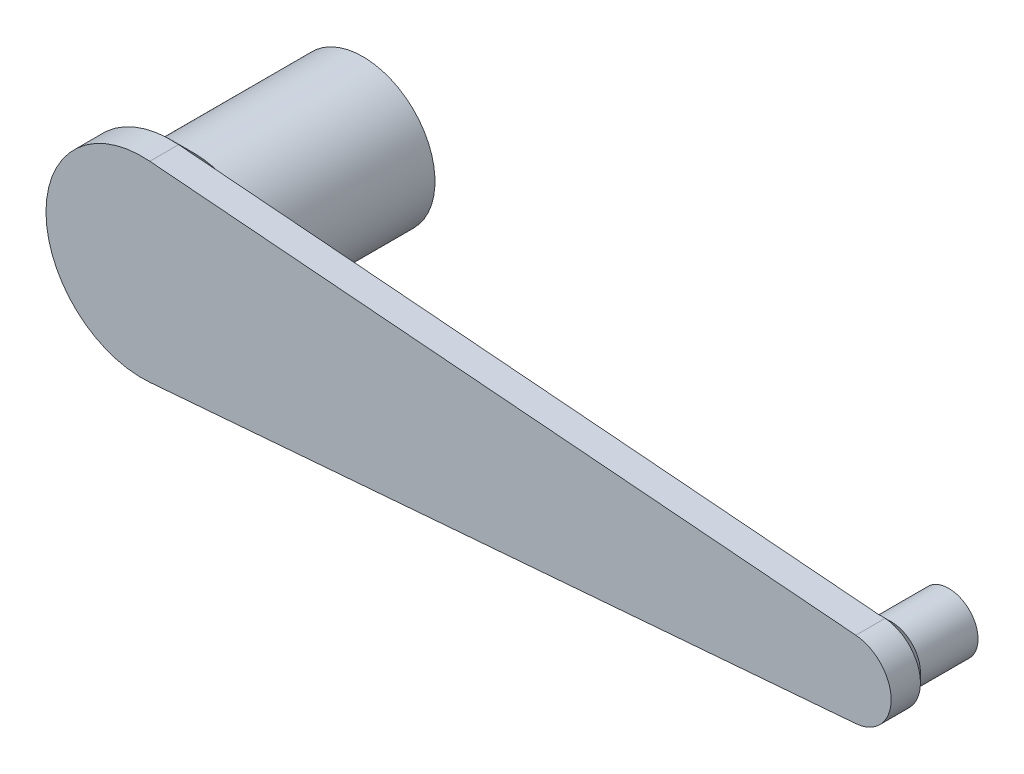
ISO-10303-21;
HEADER;
FILE_DESCRIPTION(('STEP AP214'),'2;1');
FILE_NAME('part.step','',(''),(''),'','','');
FILE_SCHEMA(('AUTOMOTIVE_DESIGN { 1 0 10303 214 1 1 1 1 }'));
ENDSEC;
DATA;
#1=APPLICATION_CONTEXT('core data for automotive mechanical design processes');
#2=APPLICATION_PROTOCOL_DEFINITION('international standard','automotive_design',2000,#1);
#3=PRODUCT_CONTEXT('',#1,'mechanical');
#4=PRODUCT('Part','Part','',(#3));
#5=PRODUCT_RELATED_PRODUCT_CATEGORY('part','',(#4));
#6=PRODUCT_DEFINITION_FORMATION('','',#4);
#7=PRODUCT_DEFINITION_CONTEXT('part definition',#1,'design');
#8=PRODUCT_DEFINITION('design','',#6,#7);
#9=PRODUCT_DEFINITION_SHAPE('','',#8);
#10=(LENGTH_UNIT() NAMED_UNIT(*) SI_UNIT(.MILLI.,.METRE.));
#11=(NAMED_UNIT(*) PLANE_ANGLE_UNIT() SI_UNIT($,.RADIAN.));
#12=(NAMED_UNIT(*) SI_UNIT($,.STERADIAN.) SOLID_ANGLE_UNIT());
#13=UNCERTAINTY_MEASURE_WITH_UNIT(LENGTH_MEASURE(1.E-05),#10,'distance_accuracy_value','');
#14=(GEOMETRIC_REPRESENTATION_CONTEXT(3) GLOBAL_UNCERTAINTY_ASSIGNED_CONTEXT((#13)) GLOBAL_UNIT_ASSIGNED_CONTEXT((#10,
#11,#12)) REPRESENTATION_CONTEXT('',''));
#15=CARTESIAN_POINT('',(0.,0.,0.));
#16=DIRECTION('',(0.,0.,1.));
#17=DIRECTION('',(1.,0.,0.));
#18=AXIS2_PLACEMENT_3D('',#15,#16,#17);
#19=CARTESIAN_POINT('',(0.,0.,3.));
#20=DIRECTION('',(0.,0.,-1.));
#21=DIRECTION('',(-1.,0.,0.));
#22=AXIS2_PLACEMENT_3D('',#19,#20,#21);
#23=CYLINDRICAL_SURFACE('',#22,10.);
#24=CARTESIAN_POINT('',(0.,0.,0.));
#25=DIRECTION('',(0.,0.,1.));
#26=DIRECTION('',(-1.,0.,0.));
#27=AXIS2_PLACEMENT_3D('',#24,#25,#26);
#28=CIRCLE('',#27,10.);
#29=CARTESIAN_POINT('',(0.810810810810811,9.96707508896528,0.));
#30=VERTEX_POINT('',#29);
#31=CARTESIAN_POINT('',(0.81081081081082,-9.96707508896528,0.));
#32=VERTEX_POINT('',#31);
#33=EDGE_CURVE('E116',#30,#32,#28,.T.);
#34=ORIENTED_EDGE('',*,*,#33,.T.);
#35=DIRECTION('',(0.,0.,-1.));
#36=VECTOR('',#35,1.);
#37=CARTESIAN_POINT('',(0.81081081081082,-9.96707508896528,3.));
#38=LINE('',#37,#36);
#39=CARTESIAN_POINT('',(0.81081081081082,-9.96707508896528,3.));
#40=VERTEX_POINT('',#39);
#41=EDGE_CURVE('E100',#40,#32,#38,.T.);
#42=ORIENTED_EDGE('',*,*,#41,.F.);
#43=CARTESIAN_POINT('',(0.,0.,3.));
#44=DIRECTION('',(0.,0.,1.));
#45=DIRECTION('',(-1.,0.,0.));
#46=AXIS2_PLACEMENT_3D('',#43,#44,#45);
#47=CIRCLE('',#46,10.);
#48=CARTESIAN_POINT('',(0.810810810810811,9.96707508896528,3.));
#49=VERTEX_POINT('',#48);
#50=EDGE_CURVE('E105',#49,#40,#47,.T.);
#51=ORIENTED_EDGE('',*,*,#50,.F.);
#52=DIRECTION('',(0.,0.,-1.));
#53=VECTOR('',#52,1.);
#54=CARTESIAN_POINT('',(0.810810810810811,9.96707508896528,3.));
#55=LINE('',#54,#53);
#56=EDGE_CURVE('E304',#49,#30,#55,.T.);
#57=ORIENTED_EDGE('',*,*,#56,.T.);
#58=EDGE_LOOP('',(#34,#42,#51,#57));
#59=FACE_BOUND('',#58,.T.);
#60=ADVANCED_FACE('F45',(#59),#23,.T.);
#61=CARTESIAN_POINT('',(74.3243243243243,-3.98683003558611,3.));
#62=DIRECTION('',(-0.0810810810810811,0.996707508896528,0.));
#63=DIRECTION('',(-0.996707508896528,-0.0810810810810811,0.));
#64=AXIS2_PLACEMENT_3D('',#61,#62,#63);
#65=PLANE('',#64);
#66=DIRECTION('',(0.996707508896528,0.0810810810810811,0.));
#67=VECTOR('',#66,1.);
#68=CARTESIAN_POINT('',(74.3243243243243,-3.98683003558611,0.));
#69=LINE('',#68,#67);
#70=CARTESIAN_POINT('',(73.6919842987352,-4.03827021480415,0.));
#71=VERTEX_POINT('',#70);
#72=EDGE_CURVE('E296',#32,#71,#69,.T.);
#73=ORIENTED_EDGE('',*,*,#72,.T.);
#74=CARTESIAN_POINT('',(73.6919842987352,-4.03827021480415,0.));
#75=CARTESIAN_POINT('',(73.7442956502319,-4.03401474276817,-0.00822470448053856));
#76=CARTESIAN_POINT('',(73.7967617841526,-4.0297466793489,-0.0154723488356455));
#77=CARTESIAN_POINT('',(73.9018514925602,-4.02119774489007,-0.0279440046137584));
#78=CARTESIAN_POINT('',(73.95447470798,-4.01691690306022,-0.0331710659839847));
#79=CARTESIAN_POINT('',(74.0598871762658,-4.00834171243333,-0.0415574676224749));
#80=CARTESIAN_POINT('',(74.1126764345497,-4.00404736319554,-0.0447167397021608));
#81=CARTESIAN_POINT('',(74.2184182000827,-3.99544538459269,-0.0489415333459449));
#82=CARTESIAN_POINT('',(74.271370833499,-3.99113774496404,-0.0500038701051256));
#83=CARTESIAN_POINT('',(74.3243243243243,-3.98683003558611,-0.0500000000000007));
#84=B_SPLINE_CURVE_WITH_KNOTS('',3,(#74,#75,#76,#77,#78,#79,#80,#81,#82,#83),.UNSPECIFIED.,.F.,
.F.,(4,2,2,2,4),(0.,0.159368060338297,0.31849461609862,0.47762641904103,0.636999724416219),.UNSPECIFIED.);
#85=CARTESIAN_POINT('',(74.3243243243243,-3.98683003558611,-0.050000000000001));
#86=VERTEX_POINT('',#85);
#87=EDGE_CURVE('E132',#71,#86,#84,.T.);
#88=ORIENTED_EDGE('',*,*,#87,.T.);
#89=DIRECTION('',(0.,0.,-1.));
#90=VECTOR('',#89,1.);
#91=CARTESIAN_POINT('',(74.3243243243243,-3.98683003558611,3.));
#92=LINE('',#91,#90);
#93=CARTESIAN_POINT('',(74.3243243243243,-3.98683003558611,3.));
#94=VERTEX_POINT('',#93);
#95=EDGE_CURVE('E69',#94,#86,#92,.T.);
#96=ORIENTED_EDGE('',*,*,#95,.F.);
#97=DIRECTION('',(0.996707508896528,0.0810810810810811,0.));
#98=VECTOR('',#97,1.);
#99=CARTESIAN_POINT('',(74.3243243243243,-3.98683003558611,3.));
#100=LINE('',#99,#98);
#101=EDGE_CURVE('E95',#40,#94,#100,.T.);
#102=ORIENTED_EDGE('',*,*,#101,.F.);
#103=ORIENTED_EDGE('',*,*,#41,.T.);
#104=EDGE_LOOP('',(#73,#88,#96,#102,#103));
#105=FACE_BOUND('',#104,.T.);
#106=ADVANCED_FACE('F98',(#105),#65,.F.);
#107=CARTESIAN_POINT('',(74.,0.,3.));
#108=DIRECTION('',(0.,0.,-1.));
#109=DIRECTION('',(-1.,0.,0.));
#110=AXIS2_PLACEMENT_3D('',#107,#108,#109);
#111=CYLINDRICAL_SURFACE('',#110,4.);
#112=ORIENTED_EDGE('',*,*,#95,.T.);
#113=CARTESIAN_POINT('',(74.,0.,-0.0500000000000002));
#114=DIRECTION('',(0.,0.,1.));
#115=DIRECTION('',(1.,0.,0.));
#116=AXIS2_PLACEMENT_3D('',#113,#114,#115);
#117=CIRCLE('',#116,4.);
#118=CARTESIAN_POINT('',(74.3243243243243,3.98683003558611,-0.0500000000000006));
#119=VERTEX_POINT('',#118);
#120=EDGE_CURVE('E140',#86,#119,#117,.T.);
#121=ORIENTED_EDGE('',*,*,#120,.T.);
#122=DIRECTION('',(0.,0.,-1.));
#123=VECTOR('',#122,1.);
#124=CARTESIAN_POINT('',(74.3243243243243,3.98683003558611,3.));
#125=LINE('',#124,#123);
#126=CARTESIAN_POINT('',(74.3243243243243,3.98683003558611,3.));
#127=VERTEX_POINT('',#126);
#128=EDGE_CURVE('E62',#127,#119,#125,.T.);
#129=ORIENTED_EDGE('',*,*,#128,.F.);
#130=CARTESIAN_POINT('',(74.,0.,3.));
#131=DIRECTION('',(0.,0.,1.));
#132=DIRECTION('',(-1.,0.,0.));
#133=AXIS2_PLACEMENT_3D('',#130,#131,#132);
#134=CIRCLE('',#133,4.);
#135=EDGE_CURVE('E104',#94,#127,#134,.T.);
#136=ORIENTED_EDGE('',*,*,#135,.F.);
#137=EDGE_LOOP('',(#112,#121,#129,#136));
#138=FACE_BOUND('',#137,.T.);
#139=ADVANCED_FACE('F166',(#138),#111,.T.);
#140=CARTESIAN_POINT('',(0.810810810810811,9.96707508896528,3.));
#141=DIRECTION('',(-0.0810810810810811,-0.996707508896528,0.));
#142=DIRECTION('',(0.996707508896528,-0.0810810810810811,0.));
#143=AXIS2_PLACEMENT_3D('',#140,#141,#142);
#144=PLANE('',#143);
#145=ORIENTED_EDGE('',*,*,#128,.T.);
#146=CARTESIAN_POINT('',(74.3243243243243,3.98683003558611,-0.0500000000000004));
#147=CARTESIAN_POINT('',(74.2713708334991,3.99113774496404,-0.0500038701051236));
#148=CARTESIAN_POINT('',(74.2184182000827,3.99544538459269,-0.0489415333459422));
#149=CARTESIAN_POINT('',(74.1126764345497,4.00404736319555,-0.044716739702158));
#150=CARTESIAN_POINT('',(74.0598871762658,4.00834171243333,-0.0415574676224724));
#151=CARTESIAN_POINT('',(73.95447470798,4.01691690306022,-0.0331710659839832));
#152=CARTESIAN_POINT('',(73.9018514925602,4.02119774489007,-0.0279440046137577));
#153=CARTESIAN_POINT('',(73.7967617841526,4.0297466793489,-0.015472348835646));
#154=CARTESIAN_POINT('',(73.7442956502319,4.03401474276817,-0.00822470448053942));
#155=CARTESIAN_POINT('',(73.6919842987352,4.03827021480415,0.));
#156=B_SPLINE_CURVE_WITH_KNOTS('',3,(#146,#147,#148,#149,#150,#151,#152,#153,#154,#155),
.UNSPECIFIED.,.F.,.F.,(4,2,2,2,4),(0.,0.159373305375176,0.318505108317586,0.477631664077895,
0.636999724416192),.UNSPECIFIED.);
#157=CARTESIAN_POINT('',(73.6919842987352,4.03827021480415,0.));
#158=VERTEX_POINT('',#157);
#159=EDGE_CURVE('E155',#119,#158,#156,.T.);
#160=ORIENTED_EDGE('',*,*,#159,.T.);
#161=DIRECTION('',(-0.996707508896528,0.0810810810810811,0.));
#162=VECTOR('',#161,1.);
#163=CARTESIAN_POINT('',(0.810810810810811,9.96707508896528,0.));
#164=LINE('',#163,#162);
#165=EDGE_CURVE('E114',#158,#30,#164,.T.);
#166=ORIENTED_EDGE('',*,*,#165,.T.);
#167=ORIENTED_EDGE('',*,*,#56,.F.);
#168=DIRECTION('',(-0.996707508896528,0.0810810810810811,0.));
#169=VECTOR('',#168,1.);
#170=CARTESIAN_POINT('',(0.810810810810811,9.96707508896528,3.));
#171=LINE('',#170,#169);
#172=EDGE_CURVE('E109',#127,#49,#171,.T.);
#173=ORIENTED_EDGE('',*,*,#172,.F.);
#174=EDGE_LOOP('',(#145,#160,#166,#167,#173));
#175=FACE_BOUND('',#174,.T.);
#176=ADVANCED_FACE('F162',(#175),#144,.F.);
#177=CARTESIAN_POINT('',(0.,0.,3.));
#178=DIRECTION('',(0.,0.,-1.));
#179=DIRECTION('',(-1.,0.,0.));
#180=AXIS2_PLACEMENT_3D('',#177,#178,#179);
#181=PLANE('',#180);
#182=ORIENTED_EDGE('',*,*,#50,.T.);
#183=ORIENTED_EDGE('',*,*,#101,.T.);
#184=ORIENTED_EDGE('',*,*,#135,.T.);
#185=ORIENTED_EDGE('',*,*,#172,.T.);
#186=EDGE_LOOP('',(#182,#183,#184,#185));
#187=FACE_BOUND('',#186,.T.);
#188=ADVANCED_FACE('F108',(#187),#181,.F.);
#189=CARTESIAN_POINT('',(0.,0.,0.));
#190=DIRECTION('',(0.,0.,-1.));
#191=DIRECTION('',(-1.,0.,0.));
#192=AXIS2_PLACEMENT_3D('',#189,#190,#191);
#193=PLANE('',#192);
#194=ORIENTED_EDGE('',*,*,#72,.F.);
#195=CARTESIAN_POINT('',(0.,0.,0.));
#196=DIRECTION('',(0.,0.,-1.));
#197=DIRECTION('',(-1.,0.,0.));
#198=AXIS2_PLACEMENT_3D('',#195,#196,#197);
#199=CIRCLE('',#198,9.99999999999997);
#200=EDGE_CURVE('E11',#32,#30,#199,.F.);
#201=ORIENTED_EDGE('',*,*,#200,.T.);
#202=ORIENTED_EDGE('',*,*,#165,.F.);
#203=CARTESIAN_POINT('',(74.,0.,0.));
#204=DIRECTION('',(0.,0.,-1.));
#205=DIRECTION('',(-1.,0.,0.));
#206=AXIS2_PLACEMENT_3D('',#203,#204,#205);
#207=CIRCLE('',#206,4.05);
#208=EDGE_CURVE('E124',#158,#71,#207,.F.);
#209=ORIENTED_EDGE('',*,*,#208,.T.);
#210=EDGE_LOOP('',(#194,#201,#202,#209));
#211=FACE_BOUND('',#210,.T.);
#212=ADVANCED_FACE('F167',(#211),#193,.T.);
#213=CARTESIAN_POINT('',(74.,0.,-7.));
#214=DIRECTION('',(0.,0.,1.));
#215=DIRECTION('',(1.,0.,0.));
#216=AXIS2_PLACEMENT_3D('',#213,#214,#215);
#217=CYLINDRICAL_SURFACE('',#216,3.04999999999999);
#218=CARTESIAN_POINT('',(74.,0.,-1.00000000000002));
#219=DIRECTION('',(0.,0.,-1.));
#220=DIRECTION('',(-1.,0.,0.));
#221=AXIS2_PLACEMENT_3D('',#218,#219,#220);
#222=CIRCLE('',#221,3.04999999999999);
#223=CARTESIAN_POINT('',(70.95,0.,-1.00000000000002));
#224=VERTEX_POINT('',#223);
#225=EDGE_CURVE('E119',#224,#224,#222,.T.);
#226=ORIENTED_EDGE('',*,*,#225,.T.);
#227=EDGE_LOOP('',(#226));
#228=FACE_BOUND('',#227,.T.);
#229=CARTESIAN_POINT('',(74.,0.,-7.));
#230=DIRECTION('',(0.,0.,-1.));
#231=DIRECTION('',(-1.,0.,0.));
#232=AXIS2_PLACEMENT_3D('',#229,#230,#231);
#233=CIRCLE('',#232,3.04999999999999);
#234=CARTESIAN_POINT('',(70.95,0.,-7.));
#235=VERTEX_POINT('',#234);
#236=EDGE_CURVE('E289',#235,#235,#233,.T.);
#237=ORIENTED_EDGE('',*,*,#236,.F.);
#238=EDGE_LOOP('',(#237));
#239=FACE_BOUND('',#238,.T.);
#240=ADVANCED_FACE('F201',(#228,#239),#217,.T.);
#241=CARTESIAN_POINT('',(74.,0.,-7.));
#242=DIRECTION('',(0.,0.,-1.));
#243=DIRECTION('',(-1.,0.,0.));
#244=AXIS2_PLACEMENT_3D('',#241,#242,#243);
#245=PLANE('',#244);
#246=ORIENTED_EDGE('',*,*,#236,.T.);
#247=EDGE_LOOP('',(#246));
#248=FACE_BOUND('',#247,.T.);
#249=ADVANCED_FACE('F152',(#248),#245,.T.);
#250=CARTESIAN_POINT('',(74.,0.,-1.00000000000002));
#251=DIRECTION('',(0.,0.,1.));
#252=DIRECTION('',(1.,0.,0.));
#253=AXIS2_PLACEMENT_3D('',#250,#251,#252);
#254=CONICAL_SURFACE('',#253,3.04999999999999,0.785398163397443);
#255=ORIENTED_EDGE('',*,*,#87,.F.);
#256=ORIENTED_EDGE('',*,*,#208,.F.);
#257=ORIENTED_EDGE('',*,*,#159,.F.);
#258=ORIENTED_EDGE('',*,*,#120,.F.);
#259=EDGE_LOOP('',(#255,#256,#257,#258));
#260=FACE_BOUND('',#259,.T.);
#261=ORIENTED_EDGE('',*,*,#225,.F.);
#262=EDGE_LOOP('',(#261));
#263=FACE_BOUND('',#262,.T.);
#264=ADVANCED_FACE('F146',(#260,#263),#254,.T.);
#265=CARTESIAN_POINT('',(0.,0.,-20.));
#266=DIRECTION('',(0.,0.,1.));
#267=DIRECTION('',(1.,0.,0.));
#268=AXIS2_PLACEMENT_3D('',#265,#266,#267);
#269=CYLINDRICAL_SURFACE('',#268,7.5);
#270=CARTESIAN_POINT('',(0.,0.,-2.5));
#271=DIRECTION('',(0.,0.,-1.));
#272=DIRECTION('',(-1.,0.,0.));
#273=AXIS2_PLACEMENT_3D('',#270,#271,#272);
#274=CIRCLE('',#273,7.5);
#275=CARTESIAN_POINT('',(-7.5,0.,-2.5));
#276=VERTEX_POINT('',#275);
#277=EDGE_CURVE('E55',#276,#276,#274,.T.);
#278=ORIENTED_EDGE('',*,*,#277,.T.);
#279=EDGE_LOOP('',(#278));
#280=FACE_BOUND('',#279,.T.);
#281=CARTESIAN_POINT('',(0.,0.,-20.));
#282=DIRECTION('',(0.,0.,-1.));
#283=DIRECTION('',(-1.,0.,0.));
#284=AXIS2_PLACEMENT_3D('',#281,#282,#283);
#285=CIRCLE('',#284,7.5);
#286=CARTESIAN_POINT('',(-7.5,0.,-20.));
#287=VERTEX_POINT('',#286);
#288=EDGE_CURVE('E292',#287,#287,#285,.T.);
#289=ORIENTED_EDGE('',*,*,#288,.F.);
#290=EDGE_LOOP('',(#289));
#291=FACE_BOUND('',#290,.T.);
#292=ADVANCED_FACE('F151',(#280,#291),#269,.T.);
#293=CARTESIAN_POINT('',(0.,0.,-20.));
#294=DIRECTION('',(0.,0.,-1.));
#295=DIRECTION('',(-1.,0.,0.));
#296=AXIS2_PLACEMENT_3D('',#293,#294,#295);
#297=PLANE('',#296);
#298=ORIENTED_EDGE('',*,*,#288,.T.);
#299=EDGE_LOOP('',(#298));
#300=FACE_BOUND('',#299,.T.);
#301=ADVANCED_FACE('F213',(#300),#297,.T.);
#302=CARTESIAN_POINT('',(0.,0.,-2.5));
#303=DIRECTION('',(0.,0.,1.));
#304=DIRECTION('',(1.,0.,0.));
#305=AXIS2_PLACEMENT_3D('',#302,#303,#304);
#306=CONICAL_SURFACE('',#305,7.5,0.785398163397442);
#307=ORIENTED_EDGE('',*,*,#33,.F.);
#308=ORIENTED_EDGE('',*,*,#200,.F.);
#309=EDGE_LOOP('',(#307,#308));
#310=FACE_BOUND('',#309,.T.);
#311=ORIENTED_EDGE('',*,*,#277,.F.);
#312=EDGE_LOOP('',(#311));
#313=FACE_BOUND('',#312,.T.);
#314=ADVANCED_FACE('F48',(#310,#313),#306,.T.);
#315=CLOSED_SHELL('',(#60,#106,#139,#176,#188,#212,#240,#249,#264,#292,#301,#314));
#316=MANIFOLD_SOLID_BREP('B2',#315);
#317=ADVANCED_BREP_SHAPE_REPRESENTATION('',(#18,#316),#14);
#318=SHAPE_DEFINITION_REPRESENTATION(#9,#317);
ENDSEC;
END-ISO-10303-21;
